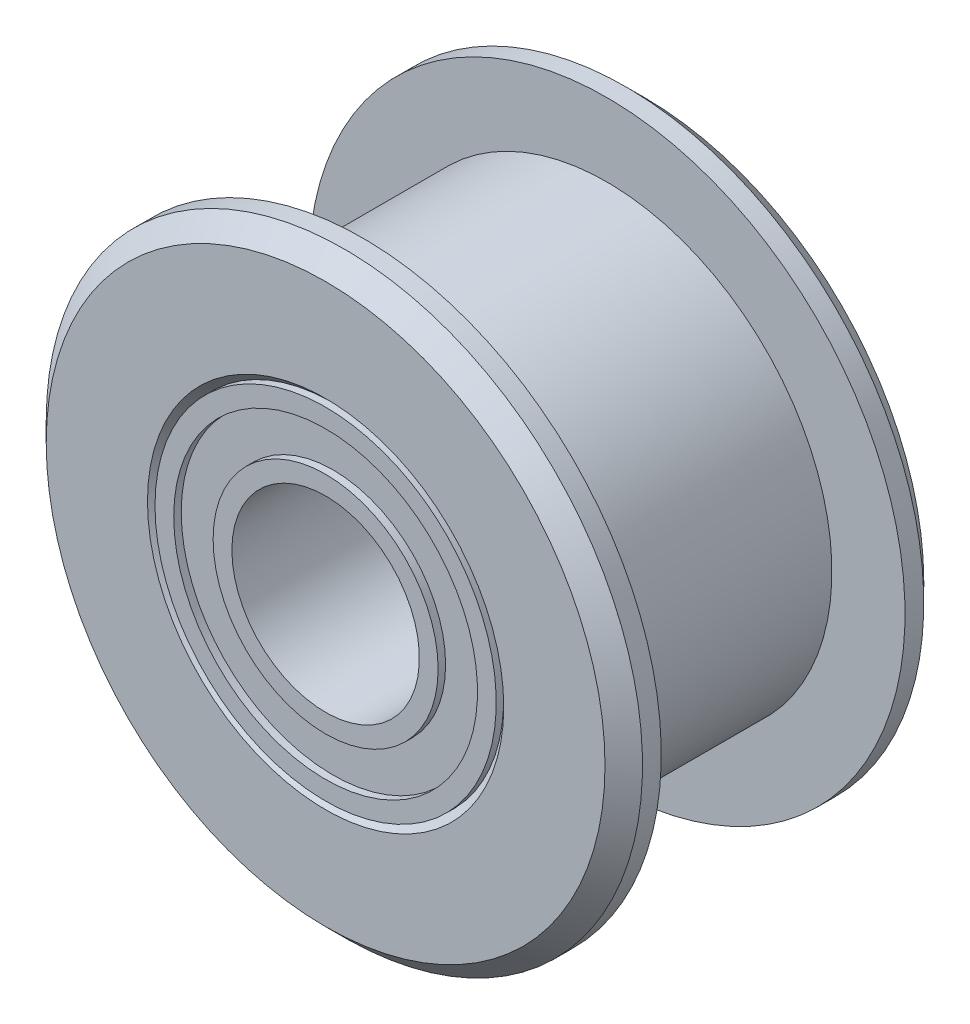
ISO-10303-21;
HEADER;
FILE_DESCRIPTION(('STEP AP214'),'2;1');
FILE_NAME('part.step','',(''),(''),'','','');
FILE_SCHEMA(('AUTOMOTIVE_DESIGN { 1 0 10303 214 1 1 1 1 }'));
ENDSEC;
DATA;
#1=APPLICATION_CONTEXT('core data for automotive mechanical design processes');
#2=APPLICATION_PROTOCOL_DEFINITION('international standard','automotive_design',2000,#1);
#3=PRODUCT_CONTEXT('',#1,'mechanical');
#4=PRODUCT('Part','Part','',(#3));
#5=PRODUCT_RELATED_PRODUCT_CATEGORY('part','',(#4));
#6=PRODUCT_DEFINITION_FORMATION('','',#4);
#7=PRODUCT_DEFINITION_CONTEXT('part definition',#1,'design');
#8=PRODUCT_DEFINITION('design','',#6,#7);
#9=PRODUCT_DEFINITION_SHAPE('','',#8);
#10=(LENGTH_UNIT() NAMED_UNIT(*) SI_UNIT(.MILLI.,.METRE.));
#11=(NAMED_UNIT(*) PLANE_ANGLE_UNIT() SI_UNIT($,.RADIAN.));
#12=(NAMED_UNIT(*) SI_UNIT($,.STERADIAN.) SOLID_ANGLE_UNIT());
#13=UNCERTAINTY_MEASURE_WITH_UNIT(LENGTH_MEASURE(1.E-05),#10,'distance_accuracy_value','');
#14=(GEOMETRIC_REPRESENTATION_CONTEXT(3) GLOBAL_UNCERTAINTY_ASSIGNED_CONTEXT((#13)) GLOBAL_UNIT_ASSIGNED_CONTEXT((#10,
#11,#12)) REPRESENTATION_CONTEXT('',''));
#15=CARTESIAN_POINT('',(0.,0.,0.));
#16=DIRECTION('',(0.,0.,1.));
#17=DIRECTION('',(1.,0.,0.));
#18=AXIS2_PLACEMENT_3D('',#15,#16,#17);
#19=CARTESIAN_POINT('',(0.,0.,6.5));
#20=DIRECTION('',(0.,0.,-1.));
#21=DIRECTION('',(0.,-1.,0.));
#22=AXIS2_PLACEMENT_3D('',#19,#20,#21);
#23=PLANE('',#22);
#24=CARTESIAN_POINT('',(0.,0.,6.5));
#25=DIRECTION('',(0.,0.,1.));
#26=DIRECTION('',(1.,0.,0.));
#27=AXIS2_PLACEMENT_3D('',#24,#25,#26);
#28=CIRCLE('',#27,6.);
#29=CARTESIAN_POINT('',(-6.,0.,6.5));
#30=VERTEX_POINT('',#29);
#31=EDGE_CURVE('E144',#30,#30,#28,.T.);
#32=ORIENTED_EDGE('',*,*,#31,.T.);
#33=EDGE_LOOP('',(#32));
#34=FACE_BOUND('',#33,.T.);
#35=CARTESIAN_POINT('',(0.,0.,6.5));
#36=DIRECTION('',(0.,0.,1.));
#37=DIRECTION('',(1.,0.,0.));
#38=AXIS2_PLACEMENT_3D('',#35,#36,#37);
#39=CIRCLE('',#38,7.95);
#40=CARTESIAN_POINT('',(-7.95,0.,6.5));
#41=VERTEX_POINT('',#40);
#42=EDGE_CURVE('E169',#41,#41,#39,.T.);
#43=ORIENTED_EDGE('',*,*,#42,.F.);
#44=EDGE_LOOP('',(#43));
#45=FACE_BOUND('',#44,.T.);
#46=ADVANCED_FACE('F16',(#34,#45),#23,.T.);
#47=CARTESIAN_POINT('',(0.,0.,0.));
#48=DIRECTION('',(0.,0.,1.));
#49=DIRECTION('',(1.,0.,0.));
#50=AXIS2_PLACEMENT_3D('',#47,#48,#49);
#51=CYLINDRICAL_SURFACE('',#50,2.5);
#52=CARTESIAN_POINT('',(0.,0.,7.5));
#53=DIRECTION('',(0.,0.,-1.));
#54=DIRECTION('',(1.,0.,0.));
#55=AXIS2_PLACEMENT_3D('',#52,#53,#54);
#56=CIRCLE('',#55,2.5);
#57=CARTESIAN_POINT('',(-2.5,0.,7.5));
#58=VERTEX_POINT('',#57);
#59=EDGE_CURVE('E134',#58,#58,#56,.T.);
#60=ORIENTED_EDGE('',*,*,#59,.F.);
#61=DIRECTION('',(0.,0.,-1.));
#62=VECTOR('',#61,1.);
#63=CARTESIAN_POINT('',(-2.5,0.,0.));
#64=LINE('',#63,#62);
#65=CARTESIAN_POINT('',(-2.5,0.,-1.));
#66=VERTEX_POINT('',#65);
#67=EDGE_CURVE('E11',#58,#66,#64,.T.);
#68=ORIENTED_EDGE('',*,*,#67,.T.);
#69=CARTESIAN_POINT('',(0.,0.,-1.));
#70=DIRECTION('',(0.,0.,-1.));
#71=DIRECTION('',(1.,0.,0.));
#72=AXIS2_PLACEMENT_3D('',#69,#70,#71);
#73=CIRCLE('',#72,2.5);
#74=EDGE_CURVE('E191',#66,#66,#73,.T.);
#75=ORIENTED_EDGE('',*,*,#74,.T.);
#76=ORIENTED_EDGE('',*,*,#67,.F.);
#77=EDGE_LOOP('',(#60,#68,#75,#76));
#78=FACE_BOUND('',#77,.T.);
#79=ADVANCED_FACE('F304',(#78),#51,.F.);
#80=CARTESIAN_POINT('',(0.,0.,7.5));
#81=DIRECTION('',(0.,0.,-1.));
#82=DIRECTION('',(1.,0.,0.));
#83=AXIS2_PLACEMENT_3D('',#80,#81,#82);
#84=CYLINDRICAL_SURFACE('',#83,3.);
#85=CARTESIAN_POINT('',(0.,0.,7.5));
#86=DIRECTION('',(0.,0.,1.));
#87=DIRECTION('',(1.,0.,0.));
#88=AXIS2_PLACEMENT_3D('',#85,#86,#87);
#89=CIRCLE('',#88,3.);
#90=CARTESIAN_POINT('',(-3.,0.,7.5));
#91=VERTEX_POINT('',#90);
#92=EDGE_CURVE('E125',#91,#91,#89,.T.);
#93=ORIENTED_EDGE('',*,*,#92,.F.);
#94=DIRECTION('',(0.,0.,-1.));
#95=VECTOR('',#94,1.);
#96=CARTESIAN_POINT('',(-3.,0.,7.5));
#97=LINE('',#96,#95);
#98=CARTESIAN_POINT('',(-3.,0.,7.3));
#99=VERTEX_POINT('',#98);
#100=EDGE_CURVE('E27',#91,#99,#97,.T.);
#101=ORIENTED_EDGE('',*,*,#100,.T.);
#102=CARTESIAN_POINT('',(0.,0.,7.3));
#103=DIRECTION('',(0.,0.,1.));
#104=DIRECTION('',(1.,0.,0.));
#105=AXIS2_PLACEMENT_3D('',#102,#103,#104);
#106=CIRCLE('',#105,3.);
#107=EDGE_CURVE('E127',#99,#99,#106,.T.);
#108=ORIENTED_EDGE('',*,*,#107,.T.);
#109=ORIENTED_EDGE('',*,*,#100,.F.);
#110=EDGE_LOOP('',(#93,#101,#108,#109));
#111=FACE_BOUND('',#110,.T.);
#112=ADVANCED_FACE('F18',(#111),#84,.T.);
#113=CARTESIAN_POINT('',(0.,0.,7.5));
#114=DIRECTION('',(0.,0.,-1.));
#115=DIRECTION('',(1.,0.,0.));
#116=AXIS2_PLACEMENT_3D('',#113,#114,#115);
#117=CYLINDRICAL_SURFACE('',#116,4.05);
#118=CARTESIAN_POINT('',(0.,0.,7.5));
#119=DIRECTION('',(0.,0.,-1.));
#120=DIRECTION('',(1.,0.,0.));
#121=AXIS2_PLACEMENT_3D('',#118,#119,#120);
#122=CIRCLE('',#121,4.05);
#123=CARTESIAN_POINT('',(-4.05,0.,7.5));
#124=VERTEX_POINT('',#123);
#125=EDGE_CURVE('E196',#124,#124,#122,.T.);
#126=ORIENTED_EDGE('',*,*,#125,.F.);
#127=DIRECTION('',(0.,0.,-1.));
#128=VECTOR('',#127,1.);
#129=CARTESIAN_POINT('',(-4.05,0.,7.5));
#130=LINE('',#129,#128);
#131=CARTESIAN_POINT('',(-4.05,0.,7.3));
#132=VERTEX_POINT('',#131);
#133=EDGE_CURVE('E129',#124,#132,#130,.T.);
#134=ORIENTED_EDGE('',*,*,#133,.T.);
#135=CARTESIAN_POINT('',(0.,0.,7.3));
#136=DIRECTION('',(0.,0.,-1.));
#137=DIRECTION('',(1.,0.,0.));
#138=AXIS2_PLACEMENT_3D('',#135,#136,#137);
#139=CIRCLE('',#138,4.05);
#140=EDGE_CURVE('E163',#132,#132,#139,.T.);
#141=ORIENTED_EDGE('',*,*,#140,.T.);
#142=ORIENTED_EDGE('',*,*,#133,.F.);
#143=EDGE_LOOP('',(#126,#134,#141,#142));
#144=FACE_BOUND('',#143,.T.);
#145=ADVANCED_FACE('F362',(#144),#117,.F.);
#146=CARTESIAN_POINT('',(0.,0.,7.3));
#147=DIRECTION('',(0.,0.,1.));
#148=DIRECTION('',(1.,0.,0.));
#149=AXIS2_PLACEMENT_3D('',#146,#147,#148);
#150=PLANE('',#149);
#151=ORIENTED_EDGE('',*,*,#107,.F.);
#152=EDGE_LOOP('',(#151));
#153=FACE_BOUND('',#152,.T.);
#154=ORIENTED_EDGE('',*,*,#140,.F.);
#155=EDGE_LOOP('',(#154));
#156=FACE_BOUND('',#155,.T.);
#157=ADVANCED_FACE('F359',(#153,#156),#150,.T.);
#158=CARTESIAN_POINT('',(0.,0.,7.5));
#159=DIRECTION('',(0.,0.,1.));
#160=DIRECTION('',(1.,0.,0.));
#161=AXIS2_PLACEMENT_3D('',#158,#159,#160);
#162=PLANE('',#161);
#163=ORIENTED_EDGE('',*,*,#125,.T.);
#164=EDGE_LOOP('',(#163));
#165=FACE_BOUND('',#164,.T.);
#166=CARTESIAN_POINT('',(0.,0.,7.5));
#167=DIRECTION('',(0.,0.,1.));
#168=DIRECTION('',(1.,0.,0.));
#169=AXIS2_PLACEMENT_3D('',#166,#167,#168);
#170=CIRCLE('',#169,4.55);
#171=CARTESIAN_POINT('',(-4.55,0.,7.5));
#172=VERTEX_POINT('',#171);
#173=EDGE_CURVE('E142',#172,#172,#170,.T.);
#174=ORIENTED_EDGE('',*,*,#173,.T.);
#175=EDGE_LOOP('',(#174));
#176=FACE_BOUND('',#175,.T.);
#177=ADVANCED_FACE('F277',(#165,#176),#162,.T.);
#178=CARTESIAN_POINT('',(0.,0.,7.4));
#179=DIRECTION('',(0.,0.,1.));
#180=DIRECTION('',(1.,0.,0.));
#181=AXIS2_PLACEMENT_3D('',#178,#179,#180);
#182=CONICAL_SURFACE('',#181,4.65,0.785398163397448);
#183=CARTESIAN_POINT('',(0.,0.,7.5));
#184=DIRECTION('',(0.,0.,-1.));
#185=DIRECTION('',(1.,0.,0.));
#186=AXIS2_PLACEMENT_3D('',#183,#184,#185);
#187=CIRCLE('',#186,4.75);
#188=CARTESIAN_POINT('',(-4.75,0.,7.5));
#189=VERTEX_POINT('',#188);
#190=EDGE_CURVE('E164',#189,#189,#187,.T.);
#191=ORIENTED_EDGE('',*,*,#190,.F.);
#192=DIRECTION('',(0.707106781186548,0.,-0.707106781186548));
#193=VECTOR('',#192,1.);
#194=CARTESIAN_POINT('',(-4.65,0.,7.4));
#195=LINE('',#194,#193);
#196=CARTESIAN_POINT('',(-4.55,0.,7.3));
#197=VERTEX_POINT('',#196);
#198=EDGE_CURVE('E200',#189,#197,#195,.T.);
#199=ORIENTED_EDGE('',*,*,#198,.T.);
#200=CARTESIAN_POINT('',(0.,0.,7.3));
#201=DIRECTION('',(0.,0.,1.));
#202=DIRECTION('',(1.,0.,0.));
#203=AXIS2_PLACEMENT_3D('',#200,#201,#202);
#204=CIRCLE('',#203,4.55);
#205=EDGE_CURVE('E154',#197,#197,#204,.T.);
#206=ORIENTED_EDGE('',*,*,#205,.F.);
#207=ORIENTED_EDGE('',*,*,#198,.F.);
#208=EDGE_LOOP('',(#191,#199,#206,#207));
#209=FACE_BOUND('',#208,.T.);
#210=ADVANCED_FACE('F284',(#209),#182,.F.);
#211=CARTESIAN_POINT('',(0.,0.,7.5));
#212=DIRECTION('',(0.,0.,-1.));
#213=DIRECTION('',(1.,0.,0.));
#214=AXIS2_PLACEMENT_3D('',#211,#212,#213);
#215=CYLINDRICAL_SURFACE('',#214,4.55);
#216=ORIENTED_EDGE('',*,*,#173,.F.);
#217=DIRECTION('',(0.,0.,-1.));
#218=VECTOR('',#217,1.);
#219=CARTESIAN_POINT('',(-4.55,0.,7.5));
#220=LINE('',#219,#218);
#221=EDGE_CURVE('E150',#172,#197,#220,.T.);
#222=ORIENTED_EDGE('',*,*,#221,.T.);
#223=ORIENTED_EDGE('',*,*,#205,.T.);
#224=ORIENTED_EDGE('',*,*,#221,.F.);
#225=EDGE_LOOP('',(#216,#222,#223,#224));
#226=FACE_BOUND('',#225,.T.);
#227=ADVANCED_FACE('F280',(#226),#215,.T.);
#228=CARTESIAN_POINT('',(0.,0.,7.5));
#229=DIRECTION('',(0.,0.,1.));
#230=DIRECTION('',(1.,0.,0.));
#231=AXIS2_PLACEMENT_3D('',#228,#229,#230);
#232=PLANE('',#231);
#233=ORIENTED_EDGE('',*,*,#59,.T.);
#234=EDGE_LOOP('',(#233));
#235=FACE_BOUND('',#234,.T.);
#236=ORIENTED_EDGE('',*,*,#92,.T.);
#237=EDGE_LOOP('',(#236));
#238=FACE_BOUND('',#237,.T.);
#239=ADVANCED_FACE('F132',(#235,#238),#232,.T.);
#240=CARTESIAN_POINT('',(0.,0.,0.));
#241=DIRECTION('',(0.,0.,1.));
#242=DIRECTION('',(1.,0.,0.));
#243=AXIS2_PLACEMENT_3D('',#240,#241,#242);
#244=CYLINDRICAL_SURFACE('',#243,6.);
#245=ORIENTED_EDGE('',*,*,#31,.F.);
#246=DIRECTION('',(0.,0.,-1.));
#247=VECTOR('',#246,1.);
#248=CARTESIAN_POINT('',(-6.,0.,0.));
#249=LINE('',#248,#247);
#250=CARTESIAN_POINT('',(-6.,0.,0.));
#251=VERTEX_POINT('',#250);
#252=EDGE_CURVE('E120',#30,#251,#249,.T.);
#253=ORIENTED_EDGE('',*,*,#252,.T.);
#254=CARTESIAN_POINT('',(0.,0.,0.));
#255=DIRECTION('',(0.,0.,1.));
#256=DIRECTION('',(1.,0.,0.));
#257=AXIS2_PLACEMENT_3D('',#254,#255,#256);
#258=CIRCLE('',#257,6.);
#259=EDGE_CURVE('E168',#251,#251,#258,.T.);
#260=ORIENTED_EDGE('',*,*,#259,.T.);
#261=ORIENTED_EDGE('',*,*,#252,.F.);
#262=EDGE_LOOP('',(#245,#253,#260,#261));
#263=FACE_BOUND('',#262,.T.);
#264=ADVANCED_FACE('F319',(#263),#244,.T.);
#265=CARTESIAN_POINT('',(0.,0.,-1.));
#266=DIRECTION('',(0.,0.,-1.));
#267=DIRECTION('',(1.,0.,0.));
#268=AXIS2_PLACEMENT_3D('',#265,#266,#267);
#269=CYLINDRICAL_SURFACE('',#268,3.);
#270=CARTESIAN_POINT('',(0.,0.,-1.));
#271=DIRECTION('',(0.,0.,1.));
#272=DIRECTION('',(1.,0.,0.));
#273=AXIS2_PLACEMENT_3D('',#270,#271,#272);
#274=CIRCLE('',#273,3.);
#275=CARTESIAN_POINT('',(-3.,0.,-1.));
#276=VERTEX_POINT('',#275);
#277=EDGE_CURVE('E20',#276,#276,#274,.T.);
#278=ORIENTED_EDGE('',*,*,#277,.T.);
#279=DIRECTION('',(0.,0.,1.));
#280=VECTOR('',#279,1.);
#281=CARTESIAN_POINT('',(-3.,0.,-1.));
#282=LINE('',#281,#280);
#283=CARTESIAN_POINT('',(-3.,0.,-0.8));
#284=VERTEX_POINT('',#283);
#285=EDGE_CURVE('E170',#276,#284,#282,.T.);
#286=ORIENTED_EDGE('',*,*,#285,.T.);
#287=CARTESIAN_POINT('',(0.,0.,-0.8));
#288=DIRECTION('',(0.,0.,1.));
#289=DIRECTION('',(1.,0.,0.));
#290=AXIS2_PLACEMENT_3D('',#287,#288,#289);
#291=CIRCLE('',#290,3.);
#292=EDGE_CURVE('E219',#284,#284,#291,.T.);
#293=ORIENTED_EDGE('',*,*,#292,.F.);
#294=ORIENTED_EDGE('',*,*,#285,.F.);
#295=EDGE_LOOP('',(#278,#286,#293,#294));
#296=FACE_BOUND('',#295,.T.);
#297=ADVANCED_FACE('F315',(#296),#269,.T.);
#298=CARTESIAN_POINT('',(0.,0.,-1.));
#299=DIRECTION('',(0.,0.,-1.));
#300=DIRECTION('',(1.,0.,0.));
#301=AXIS2_PLACEMENT_3D('',#298,#299,#300);
#302=CYLINDRICAL_SURFACE('',#301,4.05);
#303=CARTESIAN_POINT('',(0.,0.,-1.));
#304=DIRECTION('',(0.,0.,-1.));
#305=DIRECTION('',(1.,0.,0.));
#306=AXIS2_PLACEMENT_3D('',#303,#304,#305);
#307=CIRCLE('',#306,4.05);
#308=CARTESIAN_POINT('',(-4.05,0.,-1.));
#309=VERTEX_POINT('',#308);
#310=EDGE_CURVE('E220',#309,#309,#307,.T.);
#311=ORIENTED_EDGE('',*,*,#310,.T.);
#312=DIRECTION('',(0.,0.,1.));
#313=VECTOR('',#312,1.);
#314=CARTESIAN_POINT('',(-4.05,0.,-1.));
#315=LINE('',#314,#313);
#316=CARTESIAN_POINT('',(-4.05,0.,-0.8));
#317=VERTEX_POINT('',#316);
#318=EDGE_CURVE('E172',#309,#317,#315,.T.);
#319=ORIENTED_EDGE('',*,*,#318,.T.);
#320=CARTESIAN_POINT('',(0.,0.,-0.8));
#321=DIRECTION('',(0.,0.,-1.));
#322=DIRECTION('',(1.,0.,0.));
#323=AXIS2_PLACEMENT_3D('',#320,#321,#322);
#324=CIRCLE('',#323,4.05);
#325=EDGE_CURVE('E215',#317,#317,#324,.T.);
#326=ORIENTED_EDGE('',*,*,#325,.F.);
#327=ORIENTED_EDGE('',*,*,#318,.F.);
#328=EDGE_LOOP('',(#311,#319,#326,#327));
#329=FACE_BOUND('',#328,.T.);
#330=ADVANCED_FACE('F318',(#329),#302,.F.);
#331=CARTESIAN_POINT('',(0.,0.,-0.8));
#332=DIRECTION('',(0.,0.,1.));
#333=DIRECTION('',(1.,0.,0.));
#334=AXIS2_PLACEMENT_3D('',#331,#332,#333);
#335=PLANE('',#334);
#336=ORIENTED_EDGE('',*,*,#292,.T.);
#337=EDGE_LOOP('',(#336));
#338=FACE_BOUND('',#337,.T.);
#339=ORIENTED_EDGE('',*,*,#325,.T.);
#340=EDGE_LOOP('',(#339));
#341=FACE_BOUND('',#340,.T.);
#342=ADVANCED_FACE('F327',(#338,#341),#335,.F.);
#343=CARTESIAN_POINT('',(0.,0.,-1.));
#344=DIRECTION('',(0.,0.,1.));
#345=DIRECTION('',(1.,0.,0.));
#346=AXIS2_PLACEMENT_3D('',#343,#344,#345);
#347=PLANE('',#346);
#348=ORIENTED_EDGE('',*,*,#310,.F.);
#349=EDGE_LOOP('',(#348));
#350=FACE_BOUND('',#349,.T.);
#351=CARTESIAN_POINT('',(0.,0.,-1.));
#352=DIRECTION('',(0.,0.,1.));
#353=DIRECTION('',(1.,0.,0.));
#354=AXIS2_PLACEMENT_3D('',#351,#352,#353);
#355=CIRCLE('',#354,4.55);
#356=CARTESIAN_POINT('',(-4.55,0.,-1.));
#357=VERTEX_POINT('',#356);
#358=EDGE_CURVE('E186',#357,#357,#355,.T.);
#359=ORIENTED_EDGE('',*,*,#358,.F.);
#360=EDGE_LOOP('',(#359));
#361=FACE_BOUND('',#360,.T.);
#362=ADVANCED_FACE('F323',(#350,#361),#347,.F.);
#363=CARTESIAN_POINT('',(0.,0.,-0.9));
#364=DIRECTION('',(0.,0.,-1.));
#365=DIRECTION('',(1.,0.,0.));
#366=AXIS2_PLACEMENT_3D('',#363,#364,#365);
#367=CONICAL_SURFACE('',#366,4.65,0.785398163397448);
#368=CARTESIAN_POINT('',(0.,0.,-1.));
#369=DIRECTION('',(0.,0.,-1.));
#370=DIRECTION('',(1.,0.,0.));
#371=AXIS2_PLACEMENT_3D('',#368,#369,#370);
#372=CIRCLE('',#371,4.75);
#373=CARTESIAN_POINT('',(-4.75,0.,-1.));
#374=VERTEX_POINT('',#373);
#375=EDGE_CURVE('E206',#374,#374,#372,.T.);
#376=ORIENTED_EDGE('',*,*,#375,.T.);
#377=DIRECTION('',(0.707106781186548,0.,0.707106781186548));
#378=VECTOR('',#377,1.);
#379=CARTESIAN_POINT('',(-4.65,0.,-0.9));
#380=LINE('',#379,#378);
#381=CARTESIAN_POINT('',(-4.55,0.,-0.8));
#382=VERTEX_POINT('',#381);
#383=EDGE_CURVE('E214',#374,#382,#380,.T.);
#384=ORIENTED_EDGE('',*,*,#383,.T.);
#385=CARTESIAN_POINT('',(0.,0.,-0.8));
#386=DIRECTION('',(0.,0.,1.));
#387=DIRECTION('',(1.,0.,0.));
#388=AXIS2_PLACEMENT_3D('',#385,#386,#387);
#389=CIRCLE('',#388,4.55);
#390=EDGE_CURVE('E210',#382,#382,#389,.T.);
#391=ORIENTED_EDGE('',*,*,#390,.T.);
#392=ORIENTED_EDGE('',*,*,#383,.F.);
#393=EDGE_LOOP('',(#376,#384,#391,#392));
#394=FACE_BOUND('',#393,.T.);
#395=ADVANCED_FACE('F326',(#394),#367,.F.);
#396=CARTESIAN_POINT('',(0.,0.,-1.));
#397=DIRECTION('',(0.,0.,-1.));
#398=DIRECTION('',(1.,0.,0.));
#399=AXIS2_PLACEMENT_3D('',#396,#397,#398);
#400=CYLINDRICAL_SURFACE('',#399,4.55);
#401=ORIENTED_EDGE('',*,*,#358,.T.);
#402=DIRECTION('',(0.,0.,1.));
#403=VECTOR('',#402,1.);
#404=CARTESIAN_POINT('',(-4.55,0.,-1.));
#405=LINE('',#404,#403);
#406=EDGE_CURVE('E190',#357,#382,#405,.T.);
#407=ORIENTED_EDGE('',*,*,#406,.T.);
#408=ORIENTED_EDGE('',*,*,#390,.F.);
#409=ORIENTED_EDGE('',*,*,#406,.F.);
#410=EDGE_LOOP('',(#401,#407,#408,#409));
#411=FACE_BOUND('',#410,.T.);
#412=ADVANCED_FACE('F347',(#411),#400,.T.);
#413=CARTESIAN_POINT('',(0.,0.,-1.));
#414=DIRECTION('',(0.,0.,1.));
#415=DIRECTION('',(1.,0.,0.));
#416=AXIS2_PLACEMENT_3D('',#413,#414,#415);
#417=PLANE('',#416);
#418=ORIENTED_EDGE('',*,*,#74,.F.);
#419=EDGE_LOOP('',(#418));
#420=FACE_BOUND('',#419,.T.);
#421=ORIENTED_EDGE('',*,*,#277,.F.);
#422=EDGE_LOOP('',(#421));
#423=FACE_BOUND('',#422,.T.);
#424=ADVANCED_FACE('F299',(#420,#423),#417,.F.);
#425=CARTESIAN_POINT('',(0.,0.,0.));
#426=DIRECTION('',(0.,0.,-1.));
#427=DIRECTION('',(0.,-1.,0.));
#428=AXIS2_PLACEMENT_3D('',#425,#426,#427);
#429=PLANE('',#428);
#430=ORIENTED_EDGE('',*,*,#259,.F.);
#431=EDGE_LOOP('',(#430));
#432=FACE_BOUND('',#431,.T.);
#433=CARTESIAN_POINT('',(0.,0.,0.));
#434=DIRECTION('',(0.,0.,1.));
#435=DIRECTION('',(1.,0.,0.));
#436=AXIS2_PLACEMENT_3D('',#433,#434,#435);
#437=CIRCLE('',#436,7.95);
#438=CARTESIAN_POINT('',(-7.95,0.,0.));
#439=VERTEX_POINT('',#438);
#440=EDGE_CURVE('E159',#439,#439,#437,.T.);
#441=ORIENTED_EDGE('',*,*,#440,.T.);
#442=EDGE_LOOP('',(#441));
#443=FACE_BOUND('',#442,.T.);
#444=ADVANCED_FACE('F290',(#432,#443),#429,.F.);
#445=CARTESIAN_POINT('',(0.,0.,7.5));
#446=DIRECTION('',(0.,0.,1.));
#447=DIRECTION('',(1.,0.,0.));
#448=AXIS2_PLACEMENT_3D('',#445,#446,#447);
#449=PLANE('',#448);
#450=ORIENTED_EDGE('',*,*,#190,.T.);
#451=EDGE_LOOP('',(#450));
#452=FACE_BOUND('',#451,.T.);
#453=CARTESIAN_POINT('',(0.,0.,7.5));
#454=DIRECTION('',(0.,0.,-1.));
#455=DIRECTION('',(1.,0.,0.));
#456=AXIS2_PLACEMENT_3D('',#453,#454,#455);
#457=CIRCLE('',#456,7.45);
#458=CARTESIAN_POINT('',(-7.45,0.,7.5));
#459=VERTEX_POINT('',#458);
#460=EDGE_CURVE('E183',#459,#459,#457,.T.);
#461=ORIENTED_EDGE('',*,*,#460,.F.);
#462=EDGE_LOOP('',(#461));
#463=FACE_BOUND('',#462,.T.);
#464=ADVANCED_FACE('F286',(#452,#463),#449,.T.);
#465=CARTESIAN_POINT('',(0.,0.,6.5));
#466=DIRECTION('',(0.,0.,1.));
#467=DIRECTION('',(1.,0.,0.));
#468=AXIS2_PLACEMENT_3D('',#465,#466,#467);
#469=CYLINDRICAL_SURFACE('',#468,7.95);
#470=CARTESIAN_POINT('',(0.,0.,7.));
#471=DIRECTION('',(0.,0.,1.));
#472=DIRECTION('',(1.,0.,0.));
#473=AXIS2_PLACEMENT_3D('',#470,#471,#472);
#474=CIRCLE('',#473,7.95);
#475=CARTESIAN_POINT('',(-7.95,0.,7.));
#476=VERTEX_POINT('',#475);
#477=EDGE_CURVE('E182',#476,#476,#474,.T.);
#478=ORIENTED_EDGE('',*,*,#477,.F.);
#479=DIRECTION('',(0.,0.,-1.));
#480=VECTOR('',#479,1.);
#481=CARTESIAN_POINT('',(-7.95,0.,6.5));
#482=LINE('',#481,#480);
#483=EDGE_CURVE('E192',#476,#41,#482,.T.);
#484=ORIENTED_EDGE('',*,*,#483,.T.);
#485=ORIENTED_EDGE('',*,*,#42,.T.);
#486=ORIENTED_EDGE('',*,*,#483,.F.);
#487=EDGE_LOOP('',(#478,#484,#485,#486));
#488=FACE_BOUND('',#487,.T.);
#489=ADVANCED_FACE('F289',(#488),#469,.T.);
#490=CARTESIAN_POINT('',(0.,0.,7.25));
#491=DIRECTION('',(0.,0.,-1.));
#492=DIRECTION('',(1.,0.,0.));
#493=AXIS2_PLACEMENT_3D('',#490,#491,#492);
#494=CONICAL_SURFACE('',#493,7.7,0.785398163397448);
#495=ORIENTED_EDGE('',*,*,#460,.T.);
#496=DIRECTION('',(-0.707106781186548,0.,-0.707106781186548));
#497=VECTOR('',#496,1.);
#498=CARTESIAN_POINT('',(-7.7,0.,7.25));
#499=LINE('',#498,#497);
#500=EDGE_CURVE('E178',#459,#476,#499,.T.);
#501=ORIENTED_EDGE('',*,*,#500,.T.);
#502=ORIENTED_EDGE('',*,*,#477,.T.);
#503=ORIENTED_EDGE('',*,*,#500,.F.);
#504=EDGE_LOOP('',(#495,#501,#502,#503));
#505=FACE_BOUND('',#504,.T.);
#506=ADVANCED_FACE('F297',(#505),#494,.T.);
#507=CARTESIAN_POINT('',(0.,0.,-1.));
#508=DIRECTION('',(0.,0.,1.));
#509=DIRECTION('',(1.,0.,0.));
#510=AXIS2_PLACEMENT_3D('',#507,#508,#509);
#511=PLANE('',#510);
#512=ORIENTED_EDGE('',*,*,#375,.F.);
#513=EDGE_LOOP('',(#512));
#514=FACE_BOUND('',#513,.T.);
#515=CARTESIAN_POINT('',(0.,0.,-1.));
#516=DIRECTION('',(0.,0.,1.));
#517=DIRECTION('',(1.,0.,0.));
#518=AXIS2_PLACEMENT_3D('',#515,#516,#517);
#519=CIRCLE('',#518,7.45);
#520=CARTESIAN_POINT('',(-7.45,0.,-1.));
#521=VERTEX_POINT('',#520);
#522=EDGE_CURVE('E160',#521,#521,#519,.T.);
#523=ORIENTED_EDGE('',*,*,#522,.F.);
#524=EDGE_LOOP('',(#523));
#525=FACE_BOUND('',#524,.T.);
#526=ADVANCED_FACE('F332',(#514,#525),#511,.F.);
#527=CARTESIAN_POINT('',(0.,0.,0.));
#528=DIRECTION('',(0.,0.,1.));
#529=DIRECTION('',(1.,0.,0.));
#530=AXIS2_PLACEMENT_3D('',#527,#528,#529);
#531=CYLINDRICAL_SURFACE('',#530,7.95);
#532=CARTESIAN_POINT('',(0.,0.,-0.5));
#533=DIRECTION('',(0.,0.,-1.));
#534=DIRECTION('',(1.,0.,0.));
#535=AXIS2_PLACEMENT_3D('',#532,#533,#534);
#536=CIRCLE('',#535,7.95);
#537=CARTESIAN_POINT('',(-7.95,0.,-0.5));
#538=VERTEX_POINT('',#537);
#539=EDGE_CURVE('E224',#538,#538,#536,.T.);
#540=ORIENTED_EDGE('',*,*,#539,.F.);
#541=DIRECTION('',(0.,0.,1.));
#542=VECTOR('',#541,1.);
#543=CARTESIAN_POINT('',(-7.95,0.,0.));
#544=LINE('',#543,#542);
#545=EDGE_CURVE('E155',#538,#439,#544,.T.);
#546=ORIENTED_EDGE('',*,*,#545,.T.);
#547=ORIENTED_EDGE('',*,*,#440,.F.);
#548=ORIENTED_EDGE('',*,*,#545,.F.);
#549=EDGE_LOOP('',(#540,#546,#547,#548));
#550=FACE_BOUND('',#549,.T.);
#551=ADVANCED_FACE('F336',(#550),#531,.T.);
#552=CARTESIAN_POINT('',(0.,0.,-0.75));
#553=DIRECTION('',(0.,0.,1.));
#554=DIRECTION('',(1.,0.,0.));
#555=AXIS2_PLACEMENT_3D('',#552,#553,#554);
#556=CONICAL_SURFACE('',#555,7.7,0.785398163397449);
#557=ORIENTED_EDGE('',*,*,#539,.T.);
#558=DIRECTION('',(0.707106781186548,0.,-0.707106781186547));
#559=VECTOR('',#558,1.);
#560=CARTESIAN_POINT('',(-7.7,0.,-0.75));
#561=LINE('',#560,#559);
#562=EDGE_CURVE('E148',#538,#521,#561,.T.);
#563=ORIENTED_EDGE('',*,*,#562,.T.);
#564=ORIENTED_EDGE('',*,*,#522,.T.);
#565=ORIENTED_EDGE('',*,*,#562,.F.);
#566=EDGE_LOOP('',(#557,#563,#564,#565));
#567=FACE_BOUND('',#566,.T.);
#568=ADVANCED_FACE('F342',(#567),#556,.T.);
#569=CLOSED_SHELL('',(#46,#79,#112,#145,#157,#177,#210,#227,#239,#264,#297,#330,#342,#362,#395,
#412,#424,#444,#464,#489,#506,#526,#551,#568));
#570=MANIFOLD_SOLID_BREP('B1',#569);
#571=ADVANCED_BREP_SHAPE_REPRESENTATION('',(#18,#570),#14);
#572=SHAPE_DEFINITION_REPRESENTATION(#9,#571);
ENDSEC;
END-ISO-10303-21;
